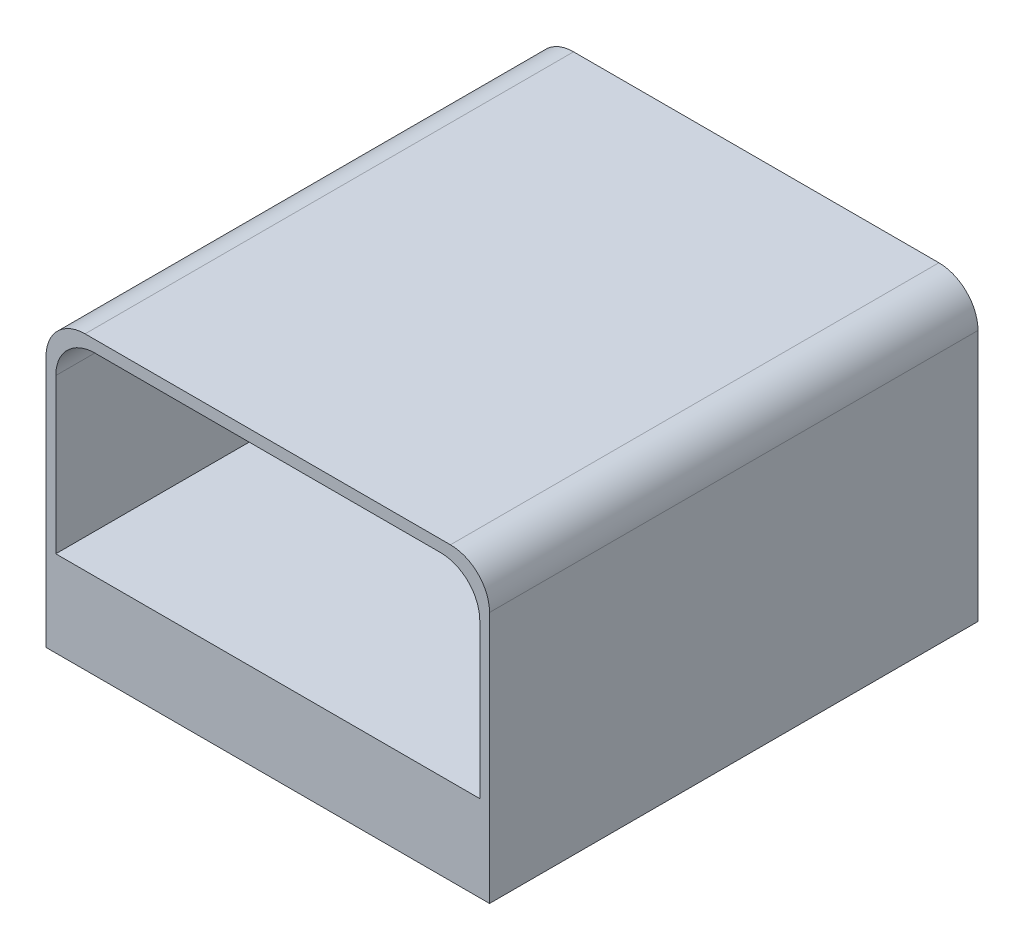
ISO-10303-21;
HEADER;
FILE_DESCRIPTION(('STEP AP214'),'2;1');
FILE_NAME('part.step','',(''),(''),'','','');
FILE_SCHEMA(('AUTOMOTIVE_DESIGN { 1 0 10303 214 1 1 1 1 }'));
ENDSEC;
DATA;
#1=APPLICATION_CONTEXT('core data for automotive mechanical design processes');
#2=APPLICATION_PROTOCOL_DEFINITION('international standard','automotive_design',2000,#1);
#3=PRODUCT_CONTEXT('',#1,'mechanical');
#4=PRODUCT('Part','Part','',(#3));
#5=PRODUCT_RELATED_PRODUCT_CATEGORY('part','',(#4));
#6=PRODUCT_DEFINITION_FORMATION('','',#4);
#7=PRODUCT_DEFINITION_CONTEXT('part definition',#1,'design');
#8=PRODUCT_DEFINITION('design','',#6,#7);
#9=PRODUCT_DEFINITION_SHAPE('','',#8);
#10=(LENGTH_UNIT() NAMED_UNIT(*) SI_UNIT(.MILLI.,.METRE.));
#11=(NAMED_UNIT(*) PLANE_ANGLE_UNIT() SI_UNIT($,.RADIAN.));
#12=(NAMED_UNIT(*) SI_UNIT($,.STERADIAN.) SOLID_ANGLE_UNIT());
#13=UNCERTAINTY_MEASURE_WITH_UNIT(LENGTH_MEASURE(1.E-05),#10,'distance_accuracy_value','');
#14=(GEOMETRIC_REPRESENTATION_CONTEXT(3) GLOBAL_UNCERTAINTY_ASSIGNED_CONTEXT((#13)) GLOBAL_UNIT_ASSIGNED_CONTEXT((#10,
#11,#12)) REPRESENTATION_CONTEXT('',''));
#15=CARTESIAN_POINT('',(0.,0.,0.));
#16=DIRECTION('',(0.,0.,1.));
#17=DIRECTION('',(1.,0.,0.));
#18=AXIS2_PLACEMENT_3D('',#15,#16,#17);
#19=CARTESIAN_POINT('',(0.,6.,0.));
#20=DIRECTION('',(0.,1.,0.));
#21=DIRECTION('',(0.,0.,1.));
#22=AXIS2_PLACEMENT_3D('',#19,#20,#21);
#23=PLANE('',#22);
#24=DIRECTION('',(0.,0.,1.));
#25=VECTOR('',#24,1.);
#26=CARTESIAN_POINT('',(10.35,6.,12.));
#27=LINE('',#26,#25);
#28=CARTESIAN_POINT('',(10.35,6.,-11.5));
#29=VERTEX_POINT('',#28);
#30=CARTESIAN_POINT('',(10.35,6.,11.5));
#31=VERTEX_POINT('',#30);
#32=EDGE_CURVE('E413',#29,#31,#27,.T.);
#33=ORIENTED_EDGE('',*,*,#32,.T.);
#34=DIRECTION('',(-1.,0.,0.));
#35=VECTOR('',#34,1.);
#36=CARTESIAN_POINT('',(-10.85,6.,11.5));
#37=LINE('',#36,#35);
#38=CARTESIAN_POINT('',(-10.35,6.,11.5));
#39=VERTEX_POINT('',#38);
#40=EDGE_CURVE('E231',#31,#39,#37,.T.);
#41=ORIENTED_EDGE('',*,*,#40,.T.);
#42=DIRECTION('',(0.,0.,1.));
#43=VECTOR('',#42,1.);
#44=CARTESIAN_POINT('',(-10.35,6.,0.));
#45=LINE('',#44,#43);
#46=CARTESIAN_POINT('',(-10.35,6.,-11.5));
#47=VERTEX_POINT('',#46);
#48=EDGE_CURVE('E416',#39,#47,#45,.F.);
#49=ORIENTED_EDGE('',*,*,#48,.T.);
#50=DIRECTION('',(-1.,0.,0.));
#51=VECTOR('',#50,1.);
#52=CARTESIAN_POINT('',(0.,6.,-11.5));
#53=LINE('',#52,#51);
#54=EDGE_CURVE('E410',#47,#29,#53,.F.);
#55=ORIENTED_EDGE('',*,*,#54,.T.);
#56=EDGE_LOOP('',(#33,#41,#49,#55));
#57=FACE_BOUND('',#56,.T.);
#58=CARTESIAN_POINT('',(0.,6.,0.));
#59=DIRECTION('',(0.,1.,0.));
#60=DIRECTION('',(0.,0.,1.));
#61=AXIS2_PLACEMENT_3D('',#58,#59,#60);
#62=CIRCLE('',#61,1.5);
#63=CARTESIAN_POINT('',(0.,6.,1.5));
#64=VERTEX_POINT('',#63);
#65=EDGE_CURVE('E290',#64,#64,#62,.F.);
#66=ORIENTED_EDGE('',*,*,#65,.F.);
#67=EDGE_LOOP('',(#66));
#68=FACE_BOUND('',#67,.T.);
#69=ADVANCED_FACE('F93',(#57,#68),#23,.F.);
#70=CARTESIAN_POINT('',(0.,4.5,0.));
#71=DIRECTION('',(0.,1.,0.));
#72=DIRECTION('',(0.,0.,1.));
#73=AXIS2_PLACEMENT_3D('',#70,#71,#72);
#74=CYLINDRICAL_SURFACE('',#73,1.5);
#75=CARTESIAN_POINT('',(0.,5.,0.));
#76=DIRECTION('',(0.,-1.,0.));
#77=DIRECTION('',(0.,0.,-1.));
#78=AXIS2_PLACEMENT_3D('',#75,#76,#77);
#79=CIRCLE('',#78,1.5);
#80=CARTESIAN_POINT('',(0.,5.,-1.5));
#81=VERTEX_POINT('',#80);
#82=EDGE_CURVE('E289',#81,#81,#79,.T.);
#83=ORIENTED_EDGE('',*,*,#82,.F.);
#84=EDGE_LOOP('',(#83));
#85=FACE_BOUND('',#84,.T.);
#86=ORIENTED_EDGE('',*,*,#65,.T.);
#87=EDGE_LOOP('',(#86));
#88=FACE_BOUND('',#87,.T.);
#89=ADVANCED_FACE('F474',(#85,#88),#74,.T.);
#90=CARTESIAN_POINT('',(0.,5.,0.));
#91=DIRECTION('',(0.,-1.,0.));
#92=DIRECTION('',(0.,0.,-1.));
#93=AXIS2_PLACEMENT_3D('',#90,#91,#92);
#94=PLANE('',#93);
#95=ORIENTED_EDGE('',*,*,#82,.T.);
#96=EDGE_LOOP('',(#95));
#97=FACE_BOUND('',#96,.T.);
#98=ADVANCED_FACE('F481',(#97),#94,.T.);
#99=CARTESIAN_POINT('',(-10.85,6.,0.));
#100=DIRECTION('',(1.,0.,0.));
#101=DIRECTION('',(0.,0.,-1.));
#102=AXIS2_PLACEMENT_3D('',#99,#100,#101);
#103=PLANE('',#102);
#104=DIRECTION('',(0.,-1.,0.));
#105=VECTOR('',#104,1.);
#106=CARTESIAN_POINT('',(-10.85,6.,-12.));
#107=LINE('',#106,#105);
#108=CARTESIAN_POINT('',(-10.85,5.5,-12.));
#109=VERTEX_POINT('',#108);
#110=CARTESIAN_POINT('',(-10.85,2.1,-12.));
#111=VERTEX_POINT('',#110);
#112=EDGE_CURVE('E268',#109,#111,#107,.T.);
#113=ORIENTED_EDGE('',*,*,#112,.F.);
#114=DIRECTION('',(0.,0.,1.));
#115=VECTOR('',#114,1.);
#116=CARTESIAN_POINT('',(-10.85,5.5,0.));
#117=LINE('',#116,#115);
#118=CARTESIAN_POINT('',(-10.85,5.5,12.));
#119=VERTEX_POINT('',#118);
#120=EDGE_CURVE('E243',#109,#119,#117,.T.);
#121=ORIENTED_EDGE('',*,*,#120,.T.);
#122=DIRECTION('',(0.,-1.,0.));
#123=VECTOR('',#122,1.);
#124=CARTESIAN_POINT('',(-10.85,6.,12.));
#125=LINE('',#124,#123);
#126=CARTESIAN_POINT('',(-10.85,2.1,12.));
#127=VERTEX_POINT('',#126);
#128=EDGE_CURVE('E254',#119,#127,#125,.T.);
#129=ORIENTED_EDGE('',*,*,#128,.T.);
#130=DIRECTION('',(0.,0.,1.));
#131=VECTOR('',#130,1.);
#132=CARTESIAN_POINT('',(-10.85,2.1,0.));
#133=LINE('',#132,#131);
#134=EDGE_CURVE('E600',#111,#127,#133,.T.);
#135=ORIENTED_EDGE('',*,*,#134,.F.);
#136=EDGE_LOOP('',(#113,#121,#129,#135));
#137=FACE_BOUND('',#136,.T.);
#138=ADVANCED_FACE('F614',(#137),#103,.T.);
#139=CARTESIAN_POINT('',(0.,6.,12.));
#140=DIRECTION('',(0.,0.,1.));
#141=DIRECTION('',(1.,0.,0.));
#142=AXIS2_PLACEMENT_3D('',#139,#140,#141);
#143=PLANE('',#142);
#144=ORIENTED_EDGE('',*,*,#128,.F.);
#145=DIRECTION('',(-1.,0.,0.));
#146=VECTOR('',#145,1.);
#147=CARTESIAN_POINT('',(10.85,5.5,12.));
#148=LINE('',#147,#146);
#149=CARTESIAN_POINT('',(10.85,5.5,12.));
#150=VERTEX_POINT('',#149);
#151=EDGE_CURVE('E228',#119,#150,#148,.F.);
#152=ORIENTED_EDGE('',*,*,#151,.T.);
#153=DIRECTION('',(0.,-1.,0.));
#154=VECTOR('',#153,1.);
#155=CARTESIAN_POINT('',(10.85,6.,12.));
#156=LINE('',#155,#154);
#157=CARTESIAN_POINT('',(10.85,2.1,12.));
#158=VERTEX_POINT('',#157);
#159=EDGE_CURVE('E251',#150,#158,#156,.T.);
#160=ORIENTED_EDGE('',*,*,#159,.T.);
#161=DIRECTION('',(-1.,0.,0.));
#162=VECTOR('',#161,1.);
#163=CARTESIAN_POINT('',(0.,2.1,12.));
#164=LINE('',#163,#162);
#165=EDGE_CURVE('E274',#158,#127,#164,.T.);
#166=ORIENTED_EDGE('',*,*,#165,.T.);
#167=EDGE_LOOP('',(#144,#152,#160,#166));
#168=FACE_BOUND('',#167,.T.);
#169=ADVANCED_FACE('F248',(#168),#143,.F.);
#170=CARTESIAN_POINT('',(10.85,6.,0.));
#171=DIRECTION('',(1.,0.,0.));
#172=DIRECTION('',(0.,0.,-1.));
#173=AXIS2_PLACEMENT_3D('',#170,#171,#172);
#174=PLANE('',#173);
#175=ORIENTED_EDGE('',*,*,#159,.F.);
#176=DIRECTION('',(0.,0.,1.));
#177=VECTOR('',#176,1.);
#178=CARTESIAN_POINT('',(10.85,5.5,-12.));
#179=LINE('',#178,#177);
#180=CARTESIAN_POINT('',(10.85,5.5,-12.));
#181=VERTEX_POINT('',#180);
#182=EDGE_CURVE('E104',#150,#181,#179,.F.);
#183=ORIENTED_EDGE('',*,*,#182,.T.);
#184=DIRECTION('',(0.,-1.,0.));
#185=VECTOR('',#184,1.);
#186=CARTESIAN_POINT('',(10.85,6.,-12.));
#187=LINE('',#186,#185);
#188=CARTESIAN_POINT('',(10.85,2.1,-12.));
#189=VERTEX_POINT('',#188);
#190=EDGE_CURVE('E262',#181,#189,#187,.T.);
#191=ORIENTED_EDGE('',*,*,#190,.T.);
#192=DIRECTION('',(0.,0.,1.));
#193=VECTOR('',#192,1.);
#194=CARTESIAN_POINT('',(10.85,2.1,0.));
#195=LINE('',#194,#193);
#196=EDGE_CURVE('E259',#189,#158,#195,.T.);
#197=ORIENTED_EDGE('',*,*,#196,.T.);
#198=EDGE_LOOP('',(#175,#183,#191,#197));
#199=FACE_BOUND('',#198,.T.);
#200=ADVANCED_FACE('F257',(#199),#174,.F.);
#201=CARTESIAN_POINT('',(0.,6.,-12.));
#202=DIRECTION('',(0.,0.,1.));
#203=DIRECTION('',(1.,0.,0.));
#204=AXIS2_PLACEMENT_3D('',#201,#202,#203);
#205=PLANE('',#204);
#206=DIRECTION('',(1.,0.,0.));
#207=VECTOR('',#206,1.);
#208=CARTESIAN_POINT('',(0.,3.,-12.));
#209=LINE('',#208,#207);
#210=CARTESIAN_POINT('',(-1.5,3.,-12.));
#211=VERTEX_POINT('',#210);
#212=CARTESIAN_POINT('',(1.5,3.,-12.));
#213=VERTEX_POINT('',#212);
#214=EDGE_CURVE('E593',#211,#213,#209,.T.);
#215=ORIENTED_EDGE('',*,*,#214,.F.);
#216=DIRECTION('',(0.,1.,0.));
#217=VECTOR('',#216,1.);
#218=CARTESIAN_POINT('',(-1.5,6.,-12.));
#219=LINE('',#218,#217);
#220=CARTESIAN_POINT('',(-1.5,5.,-12.));
#221=VERTEX_POINT('',#220);
#222=EDGE_CURVE('E582',#211,#221,#219,.T.);
#223=ORIENTED_EDGE('',*,*,#222,.T.);
#224=DIRECTION('',(1.,0.,0.));
#225=VECTOR('',#224,1.);
#226=CARTESIAN_POINT('',(0.,5.,-12.));
#227=LINE('',#226,#225);
#228=CARTESIAN_POINT('',(1.5,5.,-12.));
#229=VERTEX_POINT('',#228);
#230=EDGE_CURVE('E586',#221,#229,#227,.T.);
#231=ORIENTED_EDGE('',*,*,#230,.T.);
#232=DIRECTION('',(0.,-1.,0.));
#233=VECTOR('',#232,1.);
#234=CARTESIAN_POINT('',(1.5,6.,-12.));
#235=LINE('',#234,#233);
#236=EDGE_CURVE('E568',#229,#213,#235,.T.);
#237=ORIENTED_EDGE('',*,*,#236,.T.);
#238=EDGE_LOOP('',(#215,#223,#231,#237));
#239=FACE_BOUND('',#238,.T.);
#240=ORIENTED_EDGE('',*,*,#190,.F.);
#241=DIRECTION('',(-1.,0.,0.));
#242=VECTOR('',#241,1.);
#243=CARTESIAN_POINT('',(0.,5.5,-12.));
#244=LINE('',#243,#242);
#245=EDGE_CURVE('E13',#181,#109,#244,.T.);
#246=ORIENTED_EDGE('',*,*,#245,.T.);
#247=ORIENTED_EDGE('',*,*,#112,.T.);
#248=DIRECTION('',(-1.,0.,0.));
#249=VECTOR('',#248,1.);
#250=CARTESIAN_POINT('',(0.,2.1,-12.));
#251=LINE('',#250,#249);
#252=EDGE_CURVE('E604',#189,#111,#251,.T.);
#253=ORIENTED_EDGE('',*,*,#252,.F.);
#254=EDGE_LOOP('',(#240,#246,#247,#253));
#255=FACE_BOUND('',#254,.T.);
#256=ADVANCED_FACE('F462',(#239,#255),#205,.T.);
#257=CARTESIAN_POINT('',(8.85,14.4,0.));
#258=DIRECTION('',(0.,0.,1.));
#259=DIRECTION('',(1.,0.,0.));
#260=AXIS2_PLACEMENT_3D('',#257,#258,#259);
#261=CYLINDRICAL_SURFACE('',#260,2.);
#262=CARTESIAN_POINT('',(8.85,14.4,12.5));
#263=DIRECTION('',(0.,0.,-1.));
#264=DIRECTION('',(-1.,0.,0.));
#265=AXIS2_PLACEMENT_3D('',#262,#263,#264);
#266=CIRCLE('',#265,2.);
#267=CARTESIAN_POINT('',(8.85,16.4,12.5));
#268=VERTEX_POINT('',#267);
#269=CARTESIAN_POINT('',(10.85,14.4,12.5));
#270=VERTEX_POINT('',#269);
#271=EDGE_CURVE('E370',#268,#270,#266,.T.);
#272=ORIENTED_EDGE('',*,*,#271,.F.);
#273=DIRECTION('',(0.,0.,-1.));
#274=VECTOR('',#273,1.);
#275=CARTESIAN_POINT('',(8.85,16.4,12.5));
#276=LINE('',#275,#274);
#277=CARTESIAN_POINT('',(8.85,16.4,-12.5));
#278=VERTEX_POINT('',#277);
#279=EDGE_CURVE('E347',#278,#268,#276,.F.);
#280=ORIENTED_EDGE('',*,*,#279,.F.);
#281=CARTESIAN_POINT('',(8.85,14.4,-12.5));
#282=DIRECTION('',(0.,0.,-1.));
#283=DIRECTION('',(-1.,0.,0.));
#284=AXIS2_PLACEMENT_3D('',#281,#282,#283);
#285=CIRCLE('',#284,2.);
#286=CARTESIAN_POINT('',(10.85,14.4,-12.5));
#287=VERTEX_POINT('',#286);
#288=EDGE_CURVE('E367',#287,#278,#285,.F.);
#289=ORIENTED_EDGE('',*,*,#288,.F.);
#290=DIRECTION('',(0.,0.,-1.));
#291=VECTOR('',#290,1.);
#292=CARTESIAN_POINT('',(10.85,14.4,-12.5));
#293=LINE('',#292,#291);
#294=EDGE_CURVE('E294',#270,#287,#293,.T.);
#295=ORIENTED_EDGE('',*,*,#294,.F.);
#296=EDGE_LOOP('',(#272,#280,#289,#295));
#297=FACE_BOUND('',#296,.T.);
#298=ADVANCED_FACE('F459',(#297),#261,.F.);
#299=CARTESIAN_POINT('',(26.,16.4,0.));
#300=DIRECTION('',(0.,-1.,0.));
#301=DIRECTION('',(0.,0.,-1.));
#302=AXIS2_PLACEMENT_3D('',#299,#300,#301);
#303=PLANE('',#302);
#304=DIRECTION('',(-1.,0.,0.));
#305=VECTOR('',#304,1.);
#306=CARTESIAN_POINT('',(-13.5,16.4,-12.5));
#307=LINE('',#306,#305);
#308=CARTESIAN_POINT('',(-8.85,16.4,-12.5));
#309=VERTEX_POINT('',#308);
#310=EDGE_CURVE('E301',#278,#309,#307,.T.);
#311=ORIENTED_EDGE('',*,*,#310,.F.);
#312=ORIENTED_EDGE('',*,*,#279,.T.);
#313=DIRECTION('',(1.,0.,0.));
#314=VECTOR('',#313,1.);
#315=CARTESIAN_POINT('',(-13.5,16.4,12.5));
#316=LINE('',#315,#314);
#317=CARTESIAN_POINT('',(-8.85,16.4,12.5));
#318=VERTEX_POINT('',#317);
#319=EDGE_CURVE('E333',#318,#268,#316,.T.);
#320=ORIENTED_EDGE('',*,*,#319,.F.);
#321=DIRECTION('',(0.,0.,-1.));
#322=VECTOR('',#321,1.);
#323=CARTESIAN_POINT('',(-8.85,16.4,0.));
#324=LINE('',#323,#322);
#325=EDGE_CURVE('E343',#318,#309,#324,.T.);
#326=ORIENTED_EDGE('',*,*,#325,.T.);
#327=EDGE_LOOP('',(#311,#312,#320,#326));
#328=FACE_BOUND('',#327,.T.);
#329=ADVANCED_FACE('F456',(#328),#303,.T.);
#330=CARTESIAN_POINT('',(-8.85,14.4,0.));
#331=DIRECTION('',(0.,0.,-1.));
#332=DIRECTION('',(-1.,0.,0.));
#333=AXIS2_PLACEMENT_3D('',#330,#331,#332);
#334=CYLINDRICAL_SURFACE('',#333,2.);
#335=CARTESIAN_POINT('',(-8.85,14.4,12.5));
#336=DIRECTION('',(0.,0.,-1.));
#337=DIRECTION('',(-1.,0.,0.));
#338=AXIS2_PLACEMENT_3D('',#335,#336,#337);
#339=CIRCLE('',#338,2.);
#340=CARTESIAN_POINT('',(-10.85,14.4,12.5));
#341=VERTEX_POINT('',#340);
#342=EDGE_CURVE('E376',#341,#318,#339,.T.);
#343=ORIENTED_EDGE('',*,*,#342,.F.);
#344=DIRECTION('',(0.,0.,-1.));
#345=VECTOR('',#344,1.);
#346=CARTESIAN_POINT('',(-10.85,14.4,0.));
#347=LINE('',#346,#345);
#348=CARTESIAN_POINT('',(-10.85,14.4,-12.5));
#349=VERTEX_POINT('',#348);
#350=EDGE_CURVE('E350',#349,#341,#347,.F.);
#351=ORIENTED_EDGE('',*,*,#350,.F.);
#352=CARTESIAN_POINT('',(-8.85,14.4,-12.5));
#353=DIRECTION('',(0.,0.,-1.));
#354=DIRECTION('',(-1.,0.,0.));
#355=AXIS2_PLACEMENT_3D('',#352,#353,#354);
#356=CIRCLE('',#355,2.);
#357=EDGE_CURVE('E373',#309,#349,#356,.F.);
#358=ORIENTED_EDGE('',*,*,#357,.F.);
#359=ORIENTED_EDGE('',*,*,#325,.F.);
#360=EDGE_LOOP('',(#343,#351,#358,#359));
#361=FACE_BOUND('',#360,.T.);
#362=ADVANCED_FACE('F448',(#361),#334,.F.);
#363=CARTESIAN_POINT('',(-10.85,18.5,0.));
#364=DIRECTION('',(-1.,0.,0.));
#365=DIRECTION('',(0.,0.,1.));
#366=AXIS2_PLACEMENT_3D('',#363,#364,#365);
#367=PLANE('',#366);
#368=DIRECTION('',(0.,1.,0.));
#369=VECTOR('',#368,1.);
#370=CARTESIAN_POINT('',(-10.85,7.,-12.5));
#371=LINE('',#370,#369);
#372=CARTESIAN_POINT('',(-10.85,6.5,-12.5));
#373=VERTEX_POINT('',#372);
#374=EDGE_CURVE('E314',#373,#349,#371,.T.);
#375=ORIENTED_EDGE('',*,*,#374,.T.);
#376=ORIENTED_EDGE('',*,*,#350,.T.);
#377=DIRECTION('',(0.,1.,0.));
#378=VECTOR('',#377,1.);
#379=CARTESIAN_POINT('',(-10.85,7.,12.5));
#380=LINE('',#379,#378);
#381=CARTESIAN_POINT('',(-10.85,6.5,12.5));
#382=VERTEX_POINT('',#381);
#383=EDGE_CURVE('E309',#382,#341,#380,.T.);
#384=ORIENTED_EDGE('',*,*,#383,.F.);
#385=DIRECTION('',(0.,0.,-1.));
#386=VECTOR('',#385,1.);
#387=CARTESIAN_POINT('',(-10.85,6.5,0.));
#388=LINE('',#387,#386);
#389=EDGE_CURVE('E135',#382,#373,#388,.T.);
#390=ORIENTED_EDGE('',*,*,#389,.T.);
#391=EDGE_LOOP('',(#375,#376,#384,#390));
#392=FACE_BOUND('',#391,.T.);
#393=ADVANCED_FACE('F445',(#392),#367,.F.);
#394=CARTESIAN_POINT('',(0.,6.5,0.));
#395=DIRECTION('',(0.,1.,0.));
#396=DIRECTION('',(0.,0.,1.));
#397=AXIS2_PLACEMENT_3D('',#394,#395,#396);
#398=PLANE('',#397);
#399=ORIENTED_EDGE('',*,*,#389,.F.);
#400=DIRECTION('',(1.,0.,0.));
#401=VECTOR('',#400,1.);
#402=CARTESIAN_POINT('',(0.,6.5,12.5));
#403=LINE('',#402,#401);
#404=CARTESIAN_POINT('',(10.85,6.5,12.5));
#405=VERTEX_POINT('',#404);
#406=EDGE_CURVE('E97',#382,#405,#403,.T.);
#407=ORIENTED_EDGE('',*,*,#406,.T.);
#408=DIRECTION('',(0.,0.,-1.));
#409=VECTOR('',#408,1.);
#410=CARTESIAN_POINT('',(10.85,6.5,0.));
#411=LINE('',#410,#409);
#412=CARTESIAN_POINT('',(10.85,6.5,-12.5));
#413=VERTEX_POINT('',#412);
#414=EDGE_CURVE('E129',#405,#413,#411,.T.);
#415=ORIENTED_EDGE('',*,*,#414,.T.);
#416=DIRECTION('',(-1.,0.,0.));
#417=VECTOR('',#416,1.);
#418=CARTESIAN_POINT('',(0.,6.5,-12.5));
#419=LINE('',#418,#417);
#420=EDGE_CURVE('E308',#413,#373,#419,.T.);
#421=ORIENTED_EDGE('',*,*,#420,.T.);
#422=EDGE_LOOP('',(#399,#407,#415,#421));
#423=FACE_BOUND('',#422,.T.);
#424=ADVANCED_FACE('F95',(#423),#398,.T.);
#425=CARTESIAN_POINT('',(10.85,18.5,0.));
#426=DIRECTION('',(-1.,0.,0.));
#427=DIRECTION('',(0.,0.,1.));
#428=AXIS2_PLACEMENT_3D('',#425,#426,#427);
#429=PLANE('',#428);
#430=DIRECTION('',(0.,1.,0.));
#431=VECTOR('',#430,1.);
#432=CARTESIAN_POINT('',(10.85,7.,12.5));
#433=LINE('',#432,#431);
#434=EDGE_CURVE('E305',#405,#270,#433,.T.);
#435=ORIENTED_EDGE('',*,*,#434,.T.);
#436=ORIENTED_EDGE('',*,*,#294,.T.);
#437=DIRECTION('',(0.,1.,0.));
#438=VECTOR('',#437,1.);
#439=CARTESIAN_POINT('',(10.85,7.,-12.5));
#440=LINE('',#439,#438);
#441=EDGE_CURVE('E310',#413,#287,#440,.T.);
#442=ORIENTED_EDGE('',*,*,#441,.F.);
#443=ORIENTED_EDGE('',*,*,#414,.F.);
#444=EDGE_LOOP('',(#435,#436,#442,#443));
#445=FACE_BOUND('',#444,.T.);
#446=ADVANCED_FACE('F439',(#445),#429,.T.);
#447=CARTESIAN_POINT('',(-9.35,15.,0.));
#448=DIRECTION('',(0.,0.,1.));
#449=DIRECTION('',(1.,0.,0.));
#450=AXIS2_PLACEMENT_3D('',#447,#448,#449);
#451=CYLINDRICAL_SURFACE('',#450,2.);
#452=CARTESIAN_POINT('',(-9.35,15.,-12.5));
#453=DIRECTION('',(0.,0.,-1.));
#454=DIRECTION('',(-1.,0.,0.));
#455=AXIS2_PLACEMENT_3D('',#452,#453,#454);
#456=CIRCLE('',#455,2.);
#457=CARTESIAN_POINT('',(-11.35,15.,-12.5));
#458=VERTEX_POINT('',#457);
#459=CARTESIAN_POINT('',(-9.35,17.,-12.5));
#460=VERTEX_POINT('',#459);
#461=EDGE_CURVE('E388',#458,#460,#456,.T.);
#462=ORIENTED_EDGE('',*,*,#461,.F.);
#463=DIRECTION('',(0.,0.,1.));
#464=VECTOR('',#463,1.);
#465=CARTESIAN_POINT('',(-11.35,15.,0.));
#466=LINE('',#465,#464);
#467=CARTESIAN_POINT('',(-11.35,15.,12.5));
#468=VERTEX_POINT('',#467);
#469=EDGE_CURVE('E361',#468,#458,#466,.F.);
#470=ORIENTED_EDGE('',*,*,#469,.F.);
#471=CARTESIAN_POINT('',(-9.35,15.,12.5));
#472=DIRECTION('',(0.,0.,-1.));
#473=DIRECTION('',(-1.,0.,0.));
#474=AXIS2_PLACEMENT_3D('',#471,#472,#473);
#475=CIRCLE('',#474,2.);
#476=CARTESIAN_POINT('',(-9.35,17.,12.5));
#477=VERTEX_POINT('',#476);
#478=EDGE_CURVE('E382',#477,#468,#475,.F.);
#479=ORIENTED_EDGE('',*,*,#478,.F.);
#480=DIRECTION('',(0.,0.,1.));
#481=VECTOR('',#480,1.);
#482=CARTESIAN_POINT('',(-9.35,17.,0.));
#483=LINE('',#482,#481);
#484=EDGE_CURVE('E357',#460,#477,#483,.T.);
#485=ORIENTED_EDGE('',*,*,#484,.F.);
#486=EDGE_LOOP('',(#462,#470,#479,#485));
#487=FACE_BOUND('',#486,.T.);
#488=ADVANCED_FACE('F499',(#487),#451,.T.);
#489=CARTESIAN_POINT('',(0.,17.,0.));
#490=DIRECTION('',(0.,1.,0.));
#491=DIRECTION('',(0.,0.,1.));
#492=AXIS2_PLACEMENT_3D('',#489,#490,#491);
#493=PLANE('',#492);
#494=DIRECTION('',(-1.,0.,0.));
#495=VECTOR('',#494,1.);
#496=CARTESIAN_POINT('',(-13.5,17.,-12.5));
#497=LINE('',#496,#495);
#498=CARTESIAN_POINT('',(9.35,17.,-12.5));
#499=VERTEX_POINT('',#498);
#500=EDGE_CURVE('E300',#499,#460,#497,.T.);
#501=ORIENTED_EDGE('',*,*,#500,.T.);
#502=ORIENTED_EDGE('',*,*,#484,.T.);
#503=DIRECTION('',(1.,0.,0.));
#504=VECTOR('',#503,1.);
#505=CARTESIAN_POINT('',(-13.5,17.,12.5));
#506=LINE('',#505,#504);
#507=CARTESIAN_POINT('',(9.35,17.,12.5));
#508=VERTEX_POINT('',#507);
#509=EDGE_CURVE('E296',#477,#508,#506,.T.);
#510=ORIENTED_EDGE('',*,*,#509,.T.);
#511=DIRECTION('',(0.,0.,-1.));
#512=VECTOR('',#511,1.);
#513=CARTESIAN_POINT('',(9.35,17.,-12.5));
#514=LINE('',#513,#512);
#515=EDGE_CURVE('E353',#508,#499,#514,.T.);
#516=ORIENTED_EDGE('',*,*,#515,.T.);
#517=EDGE_LOOP('',(#501,#502,#510,#516));
#518=FACE_BOUND('',#517,.T.);
#519=ADVANCED_FACE('F487',(#518),#493,.T.);
#520=CARTESIAN_POINT('',(9.35,15.,0.));
#521=DIRECTION('',(0.,0.,1.));
#522=DIRECTION('',(1.,0.,0.));
#523=AXIS2_PLACEMENT_3D('',#520,#521,#522);
#524=CYLINDRICAL_SURFACE('',#523,2.);
#525=CARTESIAN_POINT('',(9.35,15.,12.5));
#526=DIRECTION('',(0.,0.,-1.));
#527=DIRECTION('',(-1.,0.,0.));
#528=AXIS2_PLACEMENT_3D('',#525,#526,#527);
#529=CIRCLE('',#528,2.);
#530=CARTESIAN_POINT('',(11.35,15.,12.5));
#531=VERTEX_POINT('',#530);
#532=EDGE_CURVE('E379',#531,#508,#529,.F.);
#533=ORIENTED_EDGE('',*,*,#532,.F.);
#534=DIRECTION('',(0.,0.,-1.));
#535=VECTOR('',#534,1.);
#536=CARTESIAN_POINT('',(11.35,15.,12.5));
#537=LINE('',#536,#535);
#538=CARTESIAN_POINT('',(11.35,15.,-12.5));
#539=VERTEX_POINT('',#538);
#540=EDGE_CURVE('E364',#539,#531,#537,.F.);
#541=ORIENTED_EDGE('',*,*,#540,.F.);
#542=CARTESIAN_POINT('',(9.35,15.,-12.5));
#543=DIRECTION('',(0.,0.,-1.));
#544=DIRECTION('',(-1.,0.,0.));
#545=AXIS2_PLACEMENT_3D('',#542,#543,#544);
#546=CIRCLE('',#545,2.);
#547=EDGE_CURVE('E385',#499,#539,#546,.T.);
#548=ORIENTED_EDGE('',*,*,#547,.F.);
#549=ORIENTED_EDGE('',*,*,#515,.F.);
#550=EDGE_LOOP('',(#533,#541,#548,#549));
#551=FACE_BOUND('',#550,.T.);
#552=ADVANCED_FACE('F495',(#551),#524,.T.);
#553=CARTESIAN_POINT('',(0.,7.,-12.5));
#554=DIRECTION('',(0.,0.,-1.));
#555=DIRECTION('',(-1.,0.,0.));
#556=AXIS2_PLACEMENT_3D('',#553,#554,#555);
#557=PLANE('',#556);
#558=DIRECTION('',(-1.,0.,0.));
#559=VECTOR('',#558,1.);
#560=CARTESIAN_POINT('',(0.,3.,-12.5));
#561=LINE('',#560,#559);
#562=CARTESIAN_POINT('',(1.5,3.,-12.5));
#563=VERTEX_POINT('',#562);
#564=CARTESIAN_POINT('',(-1.5,3.,-12.5));
#565=VERTEX_POINT('',#564);
#566=EDGE_CURVE('E406',#563,#565,#561,.T.);
#567=ORIENTED_EDGE('',*,*,#566,.F.);
#568=DIRECTION('',(0.,1.,0.));
#569=VECTOR('',#568,1.);
#570=CARTESIAN_POINT('',(1.5,7.,-12.5));
#571=LINE('',#570,#569);
#572=CARTESIAN_POINT('',(1.5,5.,-12.5));
#573=VERTEX_POINT('',#572);
#574=EDGE_CURVE('E398',#563,#573,#571,.T.);
#575=ORIENTED_EDGE('',*,*,#574,.T.);
#576=DIRECTION('',(-1.,0.,0.));
#577=VECTOR('',#576,1.);
#578=CARTESIAN_POINT('',(0.,5.,-12.5));
#579=LINE('',#578,#577);
#580=CARTESIAN_POINT('',(-1.5,5.,-12.5));
#581=VERTEX_POINT('',#580);
#582=EDGE_CURVE('E391',#573,#581,#579,.T.);
#583=ORIENTED_EDGE('',*,*,#582,.T.);
#584=DIRECTION('',(0.,-1.,0.));
#585=VECTOR('',#584,1.);
#586=CARTESIAN_POINT('',(-1.5,7.,-12.5));
#587=LINE('',#586,#585);
#588=EDGE_CURVE('E402',#581,#565,#587,.T.);
#589=ORIENTED_EDGE('',*,*,#588,.T.);
#590=EDGE_LOOP('',(#567,#575,#583,#589));
#591=FACE_BOUND('',#590,.T.);
#592=ORIENTED_EDGE('',*,*,#441,.T.);
#593=ORIENTED_EDGE('',*,*,#288,.T.);
#594=ORIENTED_EDGE('',*,*,#310,.T.);
#595=ORIENTED_EDGE('',*,*,#357,.T.);
#596=ORIENTED_EDGE('',*,*,#374,.F.);
#597=ORIENTED_EDGE('',*,*,#420,.F.);
#598=EDGE_LOOP('',(#592,#593,#594,#595,#596,#597));
#599=FACE_BOUND('',#598,.T.);
#600=DIRECTION('',(0.,-1.,0.));
#601=VECTOR('',#600,1.);
#602=CARTESIAN_POINT('',(-11.35,7.,-12.5));
#603=LINE('',#602,#601);
#604=CARTESIAN_POINT('',(-11.35,2.1,-12.5));
#605=VERTEX_POINT('',#604);
#606=EDGE_CURVE('E321',#458,#605,#603,.T.);
#607=ORIENTED_EDGE('',*,*,#606,.F.);
#608=ORIENTED_EDGE('',*,*,#461,.T.);
#609=ORIENTED_EDGE('',*,*,#500,.F.);
#610=ORIENTED_EDGE('',*,*,#547,.T.);
#611=DIRECTION('',(0.,-1.,0.));
#612=VECTOR('',#611,1.);
#613=CARTESIAN_POINT('',(11.35,7.,-12.5));
#614=LINE('',#613,#612);
#615=CARTESIAN_POINT('',(11.35,2.1,-12.5));
#616=VERTEX_POINT('',#615);
#617=EDGE_CURVE('E144',#539,#616,#614,.T.);
#618=ORIENTED_EDGE('',*,*,#617,.T.);
#619=DIRECTION('',(1.,0.,0.));
#620=VECTOR('',#619,1.);
#621=CARTESIAN_POINT('',(11.35,2.1,-12.5));
#622=LINE('',#621,#620);
#623=EDGE_CURVE('E286',#605,#616,#622,.T.);
#624=ORIENTED_EDGE('',*,*,#623,.F.);
#625=EDGE_LOOP('',(#607,#608,#609,#610,#618,#624));
#626=FACE_BOUND('',#625,.T.);
#627=ADVANCED_FACE('F442',(#591,#599,#626),#557,.T.);
#628=CARTESIAN_POINT('',(-11.35,7.,0.));
#629=DIRECTION('',(-1.,0.,0.));
#630=DIRECTION('',(0.,0.,1.));
#631=AXIS2_PLACEMENT_3D('',#628,#629,#630);
#632=PLANE('',#631);
#633=DIRECTION('',(0.,-1.,0.));
#634=VECTOR('',#633,1.);
#635=CARTESIAN_POINT('',(-11.35,7.,12.5));
#636=LINE('',#635,#634);
#637=CARTESIAN_POINT('',(-11.35,2.1,12.5));
#638=VERTEX_POINT('',#637);
#639=EDGE_CURVE('E295',#468,#638,#636,.T.);
#640=ORIENTED_EDGE('',*,*,#639,.F.);
#641=ORIENTED_EDGE('',*,*,#469,.T.);
#642=ORIENTED_EDGE('',*,*,#606,.T.);
#643=DIRECTION('',(0.,0.,-1.));
#644=VECTOR('',#643,1.);
#645=CARTESIAN_POINT('',(-11.35,2.1,-12.5));
#646=LINE('',#645,#644);
#647=EDGE_CURVE('E282',#638,#605,#646,.T.);
#648=ORIENTED_EDGE('',*,*,#647,.F.);
#649=EDGE_LOOP('',(#640,#641,#642,#648));
#650=FACE_BOUND('',#649,.T.);
#651=ADVANCED_FACE('F491',(#650),#632,.T.);
#652=CARTESIAN_POINT('',(0.,7.,12.5));
#653=DIRECTION('',(0.,0.,-1.));
#654=DIRECTION('',(-1.,0.,0.));
#655=AXIS2_PLACEMENT_3D('',#652,#653,#654);
#656=PLANE('',#655);
#657=ORIENTED_EDGE('',*,*,#509,.F.);
#658=ORIENTED_EDGE('',*,*,#478,.T.);
#659=ORIENTED_EDGE('',*,*,#639,.T.);
#660=DIRECTION('',(-1.,0.,0.));
#661=VECTOR('',#660,1.);
#662=CARTESIAN_POINT('',(11.35,2.1,12.5));
#663=LINE('',#662,#661);
#664=CARTESIAN_POINT('',(11.35,2.1,12.5));
#665=VERTEX_POINT('',#664);
#666=EDGE_CURVE('E278',#665,#638,#663,.T.);
#667=ORIENTED_EDGE('',*,*,#666,.F.);
#668=DIRECTION('',(0.,-1.,0.));
#669=VECTOR('',#668,1.);
#670=CARTESIAN_POINT('',(11.35,7.,12.5));
#671=LINE('',#670,#669);
#672=EDGE_CURVE('E327',#531,#665,#671,.T.);
#673=ORIENTED_EDGE('',*,*,#672,.F.);
#674=ORIENTED_EDGE('',*,*,#532,.T.);
#675=EDGE_LOOP('',(#657,#658,#659,#667,#673,#674));
#676=FACE_BOUND('',#675,.T.);
#677=ORIENTED_EDGE('',*,*,#434,.F.);
#678=ORIENTED_EDGE('',*,*,#406,.F.);
#679=ORIENTED_EDGE('',*,*,#383,.T.);
#680=ORIENTED_EDGE('',*,*,#342,.T.);
#681=ORIENTED_EDGE('',*,*,#319,.T.);
#682=ORIENTED_EDGE('',*,*,#271,.T.);
#683=EDGE_LOOP('',(#677,#678,#679,#680,#681,#682));
#684=FACE_BOUND('',#683,.T.);
#685=ADVANCED_FACE('F452',(#676,#684),#656,.F.);
#686=CARTESIAN_POINT('',(11.35,7.,0.));
#687=DIRECTION('',(-1.,0.,0.));
#688=DIRECTION('',(0.,0.,1.));
#689=AXIS2_PLACEMENT_3D('',#686,#687,#688);
#690=PLANE('',#689);
#691=ORIENTED_EDGE('',*,*,#617,.F.);
#692=ORIENTED_EDGE('',*,*,#540,.T.);
#693=ORIENTED_EDGE('',*,*,#672,.T.);
#694=DIRECTION('',(0.,0.,1.));
#695=VECTOR('',#694,1.);
#696=CARTESIAN_POINT('',(11.35,2.1,-12.5));
#697=LINE('',#696,#695);
#698=EDGE_CURVE('E266',#616,#665,#697,.T.);
#699=ORIENTED_EDGE('',*,*,#698,.F.);
#700=EDGE_LOOP('',(#691,#692,#693,#699));
#701=FACE_BOUND('',#700,.T.);
#702=ADVANCED_FACE('F490',(#701),#690,.F.);
#703=CARTESIAN_POINT('',(0.,2.1,0.));
#704=DIRECTION('',(0.,-1.,0.));
#705=DIRECTION('',(0.,0.,-1.));
#706=AXIS2_PLACEMENT_3D('',#703,#704,#705);
#707=PLANE('',#706);
#708=ORIENTED_EDGE('',*,*,#698,.T.);
#709=ORIENTED_EDGE('',*,*,#666,.T.);
#710=ORIENTED_EDGE('',*,*,#647,.T.);
#711=ORIENTED_EDGE('',*,*,#623,.T.);
#712=EDGE_LOOP('',(#708,#709,#710,#711));
#713=FACE_BOUND('',#712,.T.);
#714=ORIENTED_EDGE('',*,*,#252,.T.);
#715=ORIENTED_EDGE('',*,*,#134,.T.);
#716=ORIENTED_EDGE('',*,*,#165,.F.);
#717=ORIENTED_EDGE('',*,*,#196,.F.);
#718=EDGE_LOOP('',(#714,#715,#716,#717));
#719=FACE_BOUND('',#718,.T.);
#720=ADVANCED_FACE('F506',(#713,#719),#707,.T.);
#721=CARTESIAN_POINT('',(-1.5,3.,0.));
#722=DIRECTION('',(1.,0.,0.));
#723=DIRECTION('',(0.,0.,-1.));
#724=AXIS2_PLACEMENT_3D('',#721,#722,#723);
#725=PLANE('',#724);
#726=DIRECTION('',(0.,0.,-1.));
#727=VECTOR('',#726,1.);
#728=CARTESIAN_POINT('',(-1.5,3.,0.));
#729=LINE('',#728,#727);
#730=EDGE_CURVE('E571',#211,#565,#729,.T.);
#731=ORIENTED_EDGE('',*,*,#730,.T.);
#732=ORIENTED_EDGE('',*,*,#588,.F.);
#733=DIRECTION('',(0.,0.,-1.));
#734=VECTOR('',#733,1.);
#735=CARTESIAN_POINT('',(-1.5,5.,0.));
#736=LINE('',#735,#734);
#737=EDGE_CURVE('E430',#221,#581,#736,.T.);
#738=ORIENTED_EDGE('',*,*,#737,.F.);
#739=ORIENTED_EDGE('',*,*,#222,.F.);
#740=EDGE_LOOP('',(#731,#732,#738,#739));
#741=FACE_BOUND('',#740,.T.);
#742=ADVANCED_FACE('F511',(#741),#725,.T.);
#743=CARTESIAN_POINT('',(1.5,3.,-14.4239199949554));
#744=DIRECTION('',(-1.,0.,0.));
#745=DIRECTION('',(0.,0.,1.));
#746=AXIS2_PLACEMENT_3D('',#743,#744,#745);
#747=PLANE('',#746);
#748=DIRECTION('',(0.,0.,1.));
#749=VECTOR('',#748,1.);
#750=CARTESIAN_POINT('',(1.5,5.,-14.4239199949554));
#751=LINE('',#750,#749);
#752=EDGE_CURVE('E559',#573,#229,#751,.T.);
#753=ORIENTED_EDGE('',*,*,#752,.F.);
#754=ORIENTED_EDGE('',*,*,#574,.F.);
#755=DIRECTION('',(0.,0.,1.));
#756=VECTOR('',#755,1.);
#757=CARTESIAN_POINT('',(1.5,3.,-14.4239199949554));
#758=LINE('',#757,#756);
#759=EDGE_CURVE('E579',#563,#213,#758,.T.);
#760=ORIENTED_EDGE('',*,*,#759,.T.);
#761=ORIENTED_EDGE('',*,*,#236,.F.);
#762=EDGE_LOOP('',(#753,#754,#760,#761));
#763=FACE_BOUND('',#762,.T.);
#764=ADVANCED_FACE('F564',(#763),#747,.T.);
#765=CARTESIAN_POINT('',(0.,3.,0.));
#766=DIRECTION('',(0.,-1.,0.));
#767=DIRECTION('',(0.,0.,-1.));
#768=AXIS2_PLACEMENT_3D('',#765,#766,#767);
#769=PLANE('',#768);
#770=ORIENTED_EDGE('',*,*,#214,.T.);
#771=ORIENTED_EDGE('',*,*,#759,.F.);
#772=ORIENTED_EDGE('',*,*,#566,.T.);
#773=ORIENTED_EDGE('',*,*,#730,.F.);
#774=EDGE_LOOP('',(#770,#771,#772,#773));
#775=FACE_BOUND('',#774,.T.);
#776=ADVANCED_FACE('F577',(#775),#769,.F.);
#777=CARTESIAN_POINT('',(0.,5.,0.));
#778=DIRECTION('',(0.,-1.,0.));
#779=DIRECTION('',(0.,0.,-1.));
#780=AXIS2_PLACEMENT_3D('',#777,#778,#779);
#781=PLANE('',#780);
#782=ORIENTED_EDGE('',*,*,#737,.T.);
#783=ORIENTED_EDGE('',*,*,#582,.F.);
#784=ORIENTED_EDGE('',*,*,#752,.T.);
#785=ORIENTED_EDGE('',*,*,#230,.F.);
#786=EDGE_LOOP('',(#782,#783,#784,#785));
#787=FACE_BOUND('',#786,.T.);
#788=ADVANCED_FACE('F558',(#787),#781,.T.);
#789=CARTESIAN_POINT('',(0.,5.5,-11.5));
#790=DIRECTION('',(-1.,0.,0.));
#791=DIRECTION('',(0.,0.,1.));
#792=AXIS2_PLACEMENT_3D('',#789,#790,#791);
#793=CYLINDRICAL_SURFACE('',#792,0.5);
#794=CARTESIAN_POINT('',(-10.35,5.5,-11.5));
#795=DIRECTION('',(-0.707106781186547,0.,0.707106781186547));
#796=DIRECTION('',(0.707106781186547,0.,0.707106781186547));
#797=AXIS2_PLACEMENT_3D('',#794,#795,#796);
#798=ELLIPSE('',#797,0.707106781186547,0.5);
#799=EDGE_CURVE('E235',#109,#47,#798,.F.);
#800=ORIENTED_EDGE('',*,*,#799,.F.);
#801=ORIENTED_EDGE('',*,*,#245,.F.);
#802=CARTESIAN_POINT('',(10.35,5.5,-11.5));
#803=DIRECTION('',(-0.707106781186547,0.,-0.707106781186547));
#804=DIRECTION('',(0.707106781186547,0.,-0.707106781186547));
#805=AXIS2_PLACEMENT_3D('',#802,#803,#804);
#806=ELLIPSE('',#805,0.707106781186547,0.5);
#807=EDGE_CURVE('E241',#29,#181,#806,.T.);
#808=ORIENTED_EDGE('',*,*,#807,.F.);
#809=ORIENTED_EDGE('',*,*,#54,.F.);
#810=EDGE_LOOP('',(#800,#801,#808,#809));
#811=FACE_BOUND('',#810,.T.);
#812=ADVANCED_FACE('F623',(#811),#793,.F.);
#813=CARTESIAN_POINT('',(10.35,5.5,0.));
#814=DIRECTION('',(0.,0.,-1.));
#815=DIRECTION('',(-1.,0.,0.));
#816=AXIS2_PLACEMENT_3D('',#813,#814,#815);
#817=CYLINDRICAL_SURFACE('',#816,0.5);
#818=ORIENTED_EDGE('',*,*,#807,.T.);
#819=ORIENTED_EDGE('',*,*,#182,.F.);
#820=CARTESIAN_POINT('',(10.35,5.5,11.5));
#821=DIRECTION('',(0.707106781186547,0.,-0.707106781186547));
#822=DIRECTION('',(0.707106781186547,0.,0.707106781186547));
#823=AXIS2_PLACEMENT_3D('',#820,#821,#822);
#824=ELLIPSE('',#823,0.707106781186547,0.5);
#825=EDGE_CURVE('E225',#31,#150,#824,.T.);
#826=ORIENTED_EDGE('',*,*,#825,.F.);
#827=ORIENTED_EDGE('',*,*,#32,.F.);
#828=EDGE_LOOP('',(#818,#819,#826,#827));
#829=FACE_BOUND('',#828,.T.);
#830=ADVANCED_FACE('F239',(#829),#817,.F.);
#831=CARTESIAN_POINT('',(-10.35,5.5,0.));
#832=DIRECTION('',(0.,0.,1.));
#833=DIRECTION('',(1.,0.,0.));
#834=AXIS2_PLACEMENT_3D('',#831,#832,#833);
#835=CYLINDRICAL_SURFACE('',#834,0.5);
#836=ORIENTED_EDGE('',*,*,#799,.T.);
#837=ORIENTED_EDGE('',*,*,#48,.F.);
#838=CARTESIAN_POINT('',(-10.35,5.5,11.5));
#839=DIRECTION('',(0.707106781186547,0.,0.707106781186547));
#840=DIRECTION('',(0.707106781186547,0.,-0.707106781186547));
#841=AXIS2_PLACEMENT_3D('',#838,#839,#840);
#842=ELLIPSE('',#841,0.707106781186547,0.5);
#843=EDGE_CURVE('E236',#119,#39,#842,.F.);
#844=ORIENTED_EDGE('',*,*,#843,.F.);
#845=ORIENTED_EDGE('',*,*,#120,.F.);
#846=EDGE_LOOP('',(#836,#837,#844,#845));
#847=FACE_BOUND('',#846,.T.);
#848=ADVANCED_FACE('F618',(#847),#835,.F.);
#849=CARTESIAN_POINT('',(0.,5.5,11.5));
#850=DIRECTION('',(1.,0.,0.));
#851=DIRECTION('',(0.,0.,-1.));
#852=AXIS2_PLACEMENT_3D('',#849,#850,#851);
#853=CYLINDRICAL_SURFACE('',#852,0.5);
#854=ORIENTED_EDGE('',*,*,#825,.T.);
#855=ORIENTED_EDGE('',*,*,#151,.F.);
#856=ORIENTED_EDGE('',*,*,#843,.T.);
#857=ORIENTED_EDGE('',*,*,#40,.F.);
#858=EDGE_LOOP('',(#854,#855,#856,#857));
#859=FACE_BOUND('',#858,.T.);
#860=ADVANCED_FACE('F226',(#859),#853,.F.);
#861=CLOSED_SHELL('',(#69,#89,#98,#138,#169,#200,#256,#298,#329,#362,#393,#424,#446,#488,#519,
#552,#627,#651,#685,#702,#720,#742,#764,#776,#788,#812,#830,#848,#860));
#862=MANIFOLD_SOLID_BREP('B2',#861);
#863=ADVANCED_BREP_SHAPE_REPRESENTATION('',(#18,#862),#14);
#864=SHAPE_DEFINITION_REPRESENTATION(#9,#863);
ENDSEC;
END-ISO-10303-21;
